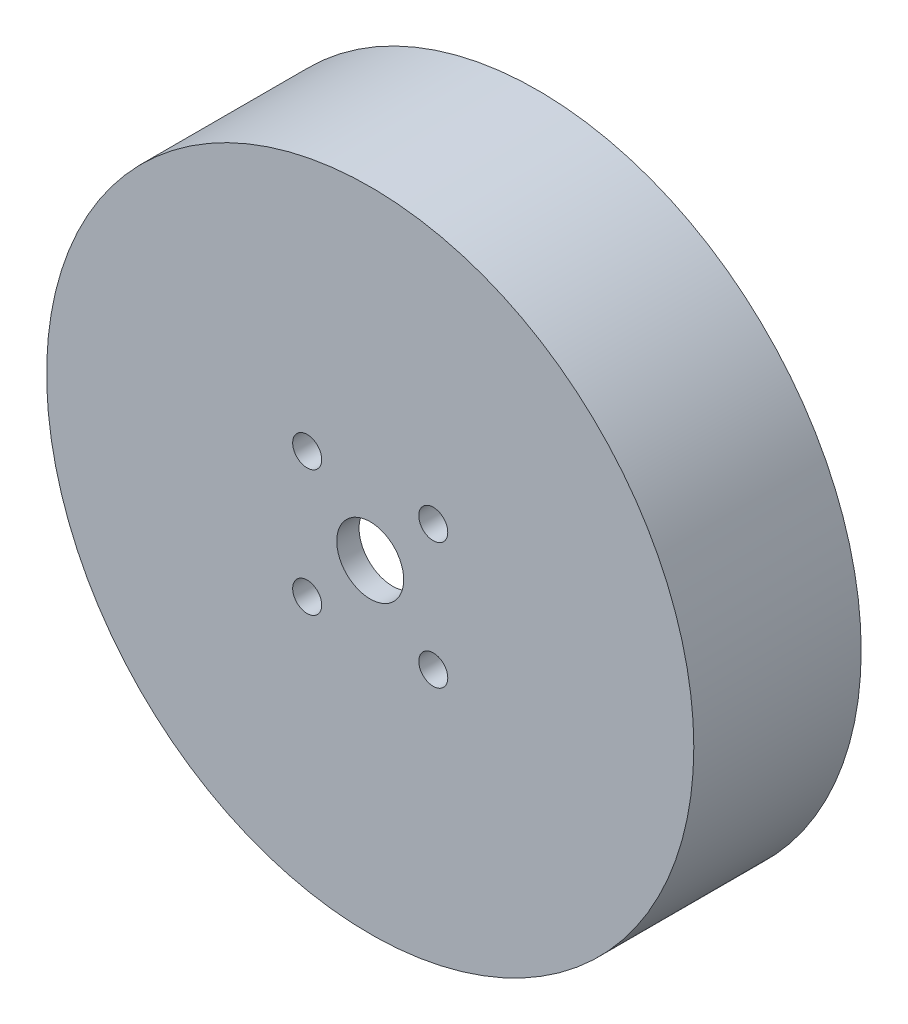
ISO-10303-21;
HEADER;
FILE_DESCRIPTION(('STEP AP214'),'2;1');
FILE_NAME('part.step','',(''),(''),'','','');
FILE_SCHEMA(('AUTOMOTIVE_DESIGN { 1 0 10303 214 1 1 1 1 }'));
ENDSEC;
DATA;
#1=APPLICATION_CONTEXT('core data for automotive mechanical design processes');
#2=APPLICATION_PROTOCOL_DEFINITION('international standard','automotive_design',2000,#1);
#3=PRODUCT_CONTEXT('',#1,'mechanical');
#4=PRODUCT('Part','Part','',(#3));
#5=PRODUCT_RELATED_PRODUCT_CATEGORY('part','',(#4));
#6=PRODUCT_DEFINITION_FORMATION('','',#4);
#7=PRODUCT_DEFINITION_CONTEXT('part definition',#1,'design');
#8=PRODUCT_DEFINITION('design','',#6,#7);
#9=PRODUCT_DEFINITION_SHAPE('','',#8);
#10=(LENGTH_UNIT() NAMED_UNIT(*) SI_UNIT(.MILLI.,.METRE.));
#11=(NAMED_UNIT(*) PLANE_ANGLE_UNIT() SI_UNIT($,.RADIAN.));
#12=(NAMED_UNIT(*) SI_UNIT($,.STERADIAN.) SOLID_ANGLE_UNIT());
#13=UNCERTAINTY_MEASURE_WITH_UNIT(LENGTH_MEASURE(1.E-05),#10,'distance_accuracy_value','');
#14=(GEOMETRIC_REPRESENTATION_CONTEXT(3) GLOBAL_UNCERTAINTY_ASSIGNED_CONTEXT((#13)) GLOBAL_UNIT_ASSIGNED_CONTEXT((#10,
#11,#12)) REPRESENTATION_CONTEXT('',''));
#15=CARTESIAN_POINT('',(0.,0.,0.));
#16=DIRECTION('',(0.,0.,1.));
#17=DIRECTION('',(1.,0.,0.));
#18=AXIS2_PLACEMENT_3D('',#15,#16,#17);
#19=CARTESIAN_POINT('',(0.,0.,13.));
#20=DIRECTION('',(0.,0.,-1.));
#21=DIRECTION('',(-1.,0.,0.));
#22=AXIS2_PLACEMENT_3D('',#19,#20,#21);
#23=CYLINDRICAL_SURFACE('',#22,25.);
#24=CARTESIAN_POINT('',(0.,0.,0.));
#25=DIRECTION('',(0.,0.,-1.));
#26=DIRECTION('',(-1.,0.,0.));
#27=AXIS2_PLACEMENT_3D('',#24,#25,#26);
#28=CIRCLE('',#27,25.);
#29=CARTESIAN_POINT('',(-25.,0.,0.));
#30=VERTEX_POINT('',#29);
#31=EDGE_CURVE('E463',#30,#30,#28,.T.);
#32=ORIENTED_EDGE('',*,*,#31,.T.);
#33=EDGE_LOOP('',(#32));
#34=FACE_BOUND('',#33,.T.);
#35=DIRECTION('',(0.,0.,1.));
#36=VECTOR('',#35,1.);
#37=CARTESIAN_POINT('',(18.6883411946512,16.605598555677,3.));
#38=LINE('',#37,#36);
#39=CARTESIAN_POINT('',(18.6883411946512,16.605598555677,3.));
#40=VERTEX_POINT('',#39);
#41=CARTESIAN_POINT('',(18.6883411946512,16.605598555677,13.));
#42=VERTEX_POINT('',#41);
#43=EDGE_CURVE('E211',#40,#42,#38,.T.);
#44=ORIENTED_EDGE('',*,*,#43,.T.);
#45=CARTESIAN_POINT('',(0.,0.,13.));
#46=DIRECTION('',(0.,0.,-1.));
#47=DIRECTION('',(-1.,0.,0.));
#48=AXIS2_PLACEMENT_3D('',#45,#46,#47);
#49=CIRCLE('',#48,25.);
#50=CARTESIAN_POINT('',(5.78401285092772,24.3217021472656,13.));
#51=VERTEX_POINT('',#50);
#52=EDGE_CURVE('E467',#51,#42,#49,.T.);
#53=ORIENTED_EDGE('',*,*,#52,.F.);
#54=DIRECTION('',(0.,0.,1.));
#55=VECTOR('',#54,1.);
#56=CARTESIAN_POINT('',(5.78401285092772,24.3217021472656,3.));
#57=LINE('',#56,#55);
#58=CARTESIAN_POINT('',(5.78401285092772,24.3217021472656,3.));
#59=VERTEX_POINT('',#58);
#60=EDGE_CURVE('E416',#59,#51,#57,.T.);
#61=ORIENTED_EDGE('',*,*,#60,.F.);
#62=CARTESIAN_POINT('',(0.,0.,3.));
#63=DIRECTION('',(0.,0.,-1.));
#64=DIRECTION('',(-1.,0.,0.));
#65=AXIS2_PLACEMENT_3D('',#62,#63,#64);
#66=CIRCLE('',#65,25.);
#67=CARTESIAN_POINT('',(-5.03669959693659,24.4873775069977,3.));
#68=VERTEX_POINT('',#67);
#69=EDGE_CURVE('E397',#68,#59,#66,.T.);
#70=ORIENTED_EDGE('',*,*,#69,.F.);
#71=DIRECTION('',(0.,0.,1.));
#72=VECTOR('',#71,1.);
#73=CARTESIAN_POINT('',(-5.03669959693659,24.4873775069977,3.));
#74=LINE('',#73,#72);
#75=CARTESIAN_POINT('',(-5.03669959693659,24.4873775069977,13.));
#76=VERTEX_POINT('',#75);
#77=EDGE_CURVE('E419',#68,#76,#74,.T.);
#78=ORIENTED_EDGE('',*,*,#77,.T.);
#79=CARTESIAN_POINT('',(-18.1712054973467,17.1699531383518,13.));
#80=VERTEX_POINT('',#79);
#81=EDGE_CURVE('E472',#80,#76,#49,.T.);
#82=ORIENTED_EDGE('',*,*,#81,.F.);
#83=DIRECTION('',(0.,0.,1.));
#84=VECTOR('',#83,1.);
#85=CARTESIAN_POINT('',(-18.1712054973467,17.1699531383518,3.));
#86=LINE('',#85,#84);
#87=CARTESIAN_POINT('',(-18.1712054973467,17.1699531383518,3.));
#88=VERTEX_POINT('',#87);
#89=EDGE_CURVE('E378',#88,#80,#86,.T.);
#90=ORIENTED_EDGE('',*,*,#89,.F.);
#91=CARTESIAN_POINT('',(0.,0.,3.));
#92=DIRECTION('',(0.,0.,-1.));
#93=DIRECTION('',(-1.,0.,0.));
#94=AXIS2_PLACEMENT_3D('',#91,#92,#93);
#95=CIRCLE('',#94,25.);
#96=CARTESIAN_POINT('',(-23.725040791588,7.88177895132088,3.));
#97=VERTEX_POINT('',#96);
#98=EDGE_CURVE('E359',#97,#88,#95,.T.);
#99=ORIENTED_EDGE('',*,*,#98,.F.);
#100=DIRECTION('',(0.,0.,1.));
#101=VECTOR('',#100,1.);
#102=CARTESIAN_POINT('',(-23.725040791588,7.88177895132088,3.));
#103=LINE('',#102,#101);
#104=CARTESIAN_POINT('',(-23.725040791588,7.88177895132088,13.));
#105=VERTEX_POINT('',#104);
#106=EDGE_CURVE('E381',#97,#105,#103,.T.);
#107=ORIENTED_EDGE('',*,*,#106,.T.);
#108=CARTESIAN_POINT('',(-23.9552183482744,-7.15174900891384,13.));
#109=VERTEX_POINT('',#108);
#110=EDGE_CURVE('E478',#109,#105,#49,.T.);
#111=ORIENTED_EDGE('',*,*,#110,.F.);
#112=DIRECTION('',(0.,0.,1.));
#113=VECTOR('',#112,1.);
#114=CARTESIAN_POINT('',(-23.9552183482743,-7.15174900891383,3.));
#115=LINE('',#114,#113);
#116=CARTESIAN_POINT('',(-23.9552183482743,-7.15174900891383,3.));
#117=VERTEX_POINT('',#116);
#118=EDGE_CURVE('E340',#117,#109,#115,.T.);
#119=ORIENTED_EDGE('',*,*,#118,.F.);
#120=CARTESIAN_POINT('',(0.,0.,3.));
#121=DIRECTION('',(0.,0.,-1.));
#122=DIRECTION('',(-1.,0.,0.));
#123=AXIS2_PLACEMENT_3D('',#120,#121,#122);
#124=CIRCLE('',#123,25.);
#125=CARTESIAN_POINT('',(-18.6883411946513,-16.6055985556769,3.));
#126=VERTEX_POINT('',#125);
#127=EDGE_CURVE('E321',#126,#117,#124,.T.);
#128=ORIENTED_EDGE('',*,*,#127,.F.);
#129=DIRECTION('',(0.,0.,1.));
#130=VECTOR('',#129,1.);
#131=CARTESIAN_POINT('',(-18.6883411946513,-16.6055985556769,3.));
#132=LINE('',#131,#130);
#133=CARTESIAN_POINT('',(-18.6883411946513,-16.6055985556769,13.));
#134=VERTEX_POINT('',#133);
#135=EDGE_CURVE('E343',#126,#134,#132,.T.);
#136=ORIENTED_EDGE('',*,*,#135,.T.);
#137=CARTESIAN_POINT('',(-5.78401285092755,-24.3217021472656,13.));
#138=VERTEX_POINT('',#137);
#139=EDGE_CURVE('E484',#138,#134,#49,.T.);
#140=ORIENTED_EDGE('',*,*,#139,.F.);
#141=DIRECTION('',(0.,0.,1.));
#142=VECTOR('',#141,1.);
#143=CARTESIAN_POINT('',(-5.78401285092755,-24.3217021472656,3.));
#144=LINE('',#143,#142);
#145=CARTESIAN_POINT('',(-5.78401285092755,-24.3217021472656,3.));
#146=VERTEX_POINT('',#145);
#147=EDGE_CURVE('E302',#146,#138,#144,.T.);
#148=ORIENTED_EDGE('',*,*,#147,.F.);
#149=CARTESIAN_POINT('',(0.,0.,3.));
#150=DIRECTION('',(0.,0.,-1.));
#151=DIRECTION('',(-1.,0.,0.));
#152=AXIS2_PLACEMENT_3D('',#149,#150,#151);
#153=CIRCLE('',#152,25.);
#154=CARTESIAN_POINT('',(5.03669959693677,-24.4873775069977,3.));
#155=VERTEX_POINT('',#154);
#156=EDGE_CURVE('E283',#155,#146,#153,.T.);
#157=ORIENTED_EDGE('',*,*,#156,.F.);
#158=DIRECTION('',(0.,0.,1.));
#159=VECTOR('',#158,1.);
#160=CARTESIAN_POINT('',(5.03669959693677,-24.4873775069977,3.));
#161=LINE('',#160,#159);
#162=CARTESIAN_POINT('',(5.03669959693677,-24.4873775069977,13.));
#163=VERTEX_POINT('',#162);
#164=EDGE_CURVE('E305',#155,#163,#161,.T.);
#165=ORIENTED_EDGE('',*,*,#164,.T.);
#166=CARTESIAN_POINT('',(18.1712054973468,-17.1699531383517,13.));
#167=VERTEX_POINT('',#166);
#168=EDGE_CURVE('E489',#167,#163,#49,.T.);
#169=ORIENTED_EDGE('',*,*,#168,.F.);
#170=DIRECTION('',(0.,0.,1.));
#171=VECTOR('',#170,1.);
#172=CARTESIAN_POINT('',(18.1712054973468,-17.1699531383517,3.));
#173=LINE('',#172,#171);
#174=CARTESIAN_POINT('',(18.1712054973468,-17.1699531383517,3.));
#175=VERTEX_POINT('',#174);
#176=EDGE_CURVE('E65',#175,#167,#173,.T.);
#177=ORIENTED_EDGE('',*,*,#176,.F.);
#178=CARTESIAN_POINT('',(0.,0.,3.));
#179=DIRECTION('',(0.,0.,-1.));
#180=DIRECTION('',(-1.,0.,0.));
#181=AXIS2_PLACEMENT_3D('',#178,#179,#180);
#182=CIRCLE('',#181,25.);
#183=CARTESIAN_POINT('',(23.7250407915881,-7.88177895132072,3.));
#184=VERTEX_POINT('',#183);
#185=EDGE_CURVE('E250',#184,#175,#182,.T.);
#186=ORIENTED_EDGE('',*,*,#185,.F.);
#187=DIRECTION('',(0.,0.,1.));
#188=VECTOR('',#187,1.);
#189=CARTESIAN_POINT('',(23.7250407915881,-7.88177895132072,3.));
#190=LINE('',#189,#188);
#191=CARTESIAN_POINT('',(23.7250407915881,-7.88177895132072,13.));
#192=VERTEX_POINT('',#191);
#193=EDGE_CURVE('E267',#184,#192,#190,.T.);
#194=ORIENTED_EDGE('',*,*,#193,.T.);
#195=CARTESIAN_POINT('',(23.9552183482743,7.151749008914,13.));
#196=VERTEX_POINT('',#195);
#197=EDGE_CURVE('E471',#196,#192,#49,.T.);
#198=ORIENTED_EDGE('',*,*,#197,.F.);
#199=DIRECTION('',(0.,0.,1.));
#200=VECTOR('',#199,1.);
#201=CARTESIAN_POINT('',(23.9552183482743,7.151749008914,3.));
#202=LINE('',#201,#200);
#203=CARTESIAN_POINT('',(23.9552183482743,7.151749008914,3.));
#204=VERTEX_POINT('',#203);
#205=EDGE_CURVE('E57',#204,#196,#202,.T.);
#206=ORIENTED_EDGE('',*,*,#205,.F.);
#207=CARTESIAN_POINT('',(0.,0.,3.));
#208=DIRECTION('',(0.,0.,-1.));
#209=DIRECTION('',(-1.,0.,0.));
#210=AXIS2_PLACEMENT_3D('',#207,#208,#209);
#211=CIRCLE('',#210,25.);
#212=EDGE_CURVE('E215',#40,#204,#211,.T.);
#213=ORIENTED_EDGE('',*,*,#212,.F.);
#214=EDGE_LOOP('',(#44,#53,#61,#70,#78,#82,#90,#99,#107,#111,#119,#128,#136,#140,#148,#157,#165,
#169,#177,#186,#194,#198,#206,#213));
#215=FACE_BOUND('',#214,.T.);
#216=ADVANCED_FACE('F41',(#34,#215),#23,.F.);
#217=CARTESIAN_POINT('',(0.,0.,13.));
#218=DIRECTION('',(0.,0.,-1.));
#219=DIRECTION('',(-1.,0.,0.));
#220=AXIS2_PLACEMENT_3D('',#217,#218,#219);
#221=PLANE('',#220);
#222=CARTESIAN_POINT('',(0.,0.,13.));
#223=DIRECTION('',(0.,0.,-1.));
#224=DIRECTION('',(-1.,0.,0.));
#225=AXIS2_PLACEMENT_3D('',#222,#223,#224);
#226=CIRCLE('',#225,3.);
#227=CARTESIAN_POINT('',(-3.,0.,13.));
#228=VERTEX_POINT('',#227);
#229=EDGE_CURVE('E426',#228,#228,#226,.F.);
#230=ORIENTED_EDGE('',*,*,#229,.T.);
#231=EDGE_LOOP('',(#230));
#232=FACE_BOUND('',#231,.T.);
#233=CARTESIAN_POINT('',(-5.65,5.65,13.));
#234=DIRECTION('',(0.,0.,-1.));
#235=DIRECTION('',(-1.,0.,0.));
#236=AXIS2_PLACEMENT_3D('',#233,#234,#235);
#237=CIRCLE('',#236,1.3);
#238=CARTESIAN_POINT('',(-6.95,5.65,13.));
#239=VERTEX_POINT('',#238);
#240=EDGE_CURVE('E448',#239,#239,#237,.F.);
#241=ORIENTED_EDGE('',*,*,#240,.T.);
#242=EDGE_LOOP('',(#241));
#243=FACE_BOUND('',#242,.T.);
#244=CARTESIAN_POINT('',(-5.65,-5.65,13.));
#245=DIRECTION('',(0.,0.,-1.));
#246=DIRECTION('',(-1.,0.,0.));
#247=AXIS2_PLACEMENT_3D('',#244,#245,#246);
#248=CIRCLE('',#247,1.3);
#249=CARTESIAN_POINT('',(-6.95,-5.65,13.));
#250=VERTEX_POINT('',#249);
#251=EDGE_CURVE('E440',#250,#250,#248,.F.);
#252=ORIENTED_EDGE('',*,*,#251,.T.);
#253=EDGE_LOOP('',(#252));
#254=FACE_BOUND('',#253,.T.);
#255=CARTESIAN_POINT('',(5.65,-5.65,13.));
#256=DIRECTION('',(0.,0.,-1.));
#257=DIRECTION('',(-1.,0.,0.));
#258=AXIS2_PLACEMENT_3D('',#255,#256,#257);
#259=CIRCLE('',#258,1.3);
#260=CARTESIAN_POINT('',(4.35,-5.65,13.));
#261=VERTEX_POINT('',#260);
#262=EDGE_CURVE('E432',#261,#261,#259,.F.);
#263=ORIENTED_EDGE('',*,*,#262,.T.);
#264=EDGE_LOOP('',(#263));
#265=FACE_BOUND('',#264,.T.);
#266=CARTESIAN_POINT('',(5.65,5.65,13.));
#267=DIRECTION('',(0.,0.,-1.));
#268=DIRECTION('',(-1.,0.,0.));
#269=AXIS2_PLACEMENT_3D('',#266,#267,#268);
#270=CIRCLE('',#269,1.3);
#271=CARTESIAN_POINT('',(4.35,5.65,13.));
#272=VERTEX_POINT('',#271);
#273=EDGE_CURVE('E431',#272,#272,#270,.F.);
#274=ORIENTED_EDGE('',*,*,#273,.T.);
#275=EDGE_LOOP('',(#274));
#276=FACE_BOUND('',#275,.T.);
#277=ORIENTED_EDGE('',*,*,#52,.T.);
#278=DIRECTION('',(0.747533647786048,0.664223942227081,0.));
#279=VECTOR('',#278,1.);
#280=CARTESIAN_POINT('',(12.8949554243093,11.4578630034171,13.));
#281=LINE('',#280,#279);
#282=CARTESIAN_POINT('',(12.8949554243093,11.4578630034171,13.));
#283=VERTEX_POINT('',#282);
#284=EDGE_CURVE('E572',#283,#42,#281,.T.);
#285=ORIENTED_EDGE('',*,*,#284,.F.);
#286=CARTESIAN_POINT('',(0.,0.,13.));
#287=DIRECTION('',(0.,0.,1.));
#288=DIRECTION('',(-1.,0.,0.));
#289=AXIS2_PLACEMENT_3D('',#286,#287,#288);
#290=CIRCLE('',#289,17.25);
#291=CARTESIAN_POINT('',(16.5291006603093,4.93470681615066,13.));
#292=VERTEX_POINT('',#291);
#293=EDGE_CURVE('E229',#292,#283,#290,.T.);
#294=ORIENTED_EDGE('',*,*,#293,.F.);
#295=DIRECTION('',(-0.958208733930972,-0.28606996035656,0.));
#296=VECTOR('',#295,1.);
#297=CARTESIAN_POINT('',(16.5291006603093,4.93470681615066,13.));
#298=LINE('',#297,#296);
#299=EDGE_CURVE('E225',#196,#292,#298,.T.);
#300=ORIENTED_EDGE('',*,*,#299,.F.);
#301=ORIENTED_EDGE('',*,*,#197,.T.);
#302=DIRECTION('',(0.949001631663523,-0.315271158052829,0.));
#303=VECTOR('',#302,1.);
#304=CARTESIAN_POINT('',(16.3702781461958,-5.4384274764113,13.));
#305=LINE('',#304,#303);
#306=CARTESIAN_POINT('',(16.3702781461958,-5.4384274764113,13.));
#307=VERTEX_POINT('',#306);
#308=EDGE_CURVE('E237',#307,#192,#305,.T.);
#309=ORIENTED_EDGE('',*,*,#308,.F.);
#310=CARTESIAN_POINT('',(0.,0.,13.));
#311=DIRECTION('',(0.,0.,1.));
#312=DIRECTION('',(-1.,0.,0.));
#313=AXIS2_PLACEMENT_3D('',#310,#311,#312);
#314=CIRCLE('',#313,17.25);
#315=CARTESIAN_POINT('',(12.5381317931693,-11.8472676654627,13.));
#316=VERTEX_POINT('',#315);
#317=EDGE_CURVE('E232',#316,#307,#314,.T.);
#318=ORIENTED_EDGE('',*,*,#317,.F.);
#319=DIRECTION('',(-0.726848219893873,0.686798125534067,0.));
#320=VECTOR('',#319,1.);
#321=CARTESIAN_POINT('',(12.5381317931693,-11.8472676654627,13.));
#322=LINE('',#321,#320);
#323=EDGE_CURVE('E247',#167,#316,#322,.T.);
#324=ORIENTED_EDGE('',*,*,#323,.F.);
#325=ORIENTED_EDGE('',*,*,#168,.T.);
#326=DIRECTION('',(0.201467983877471,-0.979495100279908,0.));
#327=VECTOR('',#326,1.);
#328=CARTESIAN_POINT('',(3.47532272188637,-16.8962904798284,13.));
#329=LINE('',#328,#327);
#330=CARTESIAN_POINT('',(3.47532272188637,-16.8962904798284,13.));
#331=VERTEX_POINT('',#330);
#332=EDGE_CURVE('E293',#331,#163,#329,.T.);
#333=ORIENTED_EDGE('',*,*,#332,.F.);
#334=CARTESIAN_POINT('',(0.,0.,13.));
#335=DIRECTION('',(0.,0.,1.));
#336=DIRECTION('',(-1.,0.,0.));
#337=AXIS2_PLACEMENT_3D('',#334,#335,#336);
#338=CIRCLE('',#337,17.25);
#339=CARTESIAN_POINT('',(-3.99096886714001,-16.7819744816133,13.));
#340=VERTEX_POINT('',#339);
#341=EDGE_CURVE('E274',#340,#331,#338,.T.);
#342=ORIENTED_EDGE('',*,*,#341,.F.);
#343=DIRECTION('',(0.231360514037102,0.972868085890625,0.));
#344=VECTOR('',#343,1.);
#345=CARTESIAN_POINT('',(-3.99096886714001,-16.7819744816133,13.));
#346=LINE('',#345,#344);
#347=EDGE_CURVE('E280',#138,#340,#346,.T.);
#348=ORIENTED_EDGE('',*,*,#347,.F.);
#349=ORIENTED_EDGE('',*,*,#139,.T.);
#350=DIRECTION('',(-0.747533647786053,-0.664223942227076,0.));
#351=VECTOR('',#350,1.);
#352=CARTESIAN_POINT('',(-12.8949554243094,-11.457863003417,13.));
#353=LINE('',#352,#351);
#354=CARTESIAN_POINT('',(-12.8949554243094,-11.457863003417,13.));
#355=VERTEX_POINT('',#354);
#356=EDGE_CURVE('E331',#355,#134,#353,.T.);
#357=ORIENTED_EDGE('',*,*,#356,.F.);
#358=CARTESIAN_POINT('',(0.,0.,13.));
#359=DIRECTION('',(0.,0.,1.));
#360=DIRECTION('',(-1.,0.,0.));
#361=AXIS2_PLACEMENT_3D('',#358,#359,#360);
#362=CIRCLE('',#361,17.25);
#363=CARTESIAN_POINT('',(-16.5291006603093,-4.93470681615055,13.));
#364=VERTEX_POINT('',#363);
#365=EDGE_CURVE('E312',#364,#355,#362,.T.);
#366=ORIENTED_EDGE('',*,*,#365,.F.);
#367=DIRECTION('',(0.958208733930974,0.286069960356554,0.));
#368=VECTOR('',#367,1.);
#369=CARTESIAN_POINT('',(-16.5291006603093,-4.93470681615055,13.));
#370=LINE('',#369,#368);
#371=EDGE_CURVE('E318',#109,#364,#370,.T.);
#372=ORIENTED_EDGE('',*,*,#371,.F.);
#373=ORIENTED_EDGE('',*,*,#110,.T.);
#374=DIRECTION('',(-0.949001631663521,0.315271158052835,0.));
#375=VECTOR('',#374,1.);
#376=CARTESIAN_POINT('',(-16.3702781461957,5.43842747641141,13.));
#377=LINE('',#376,#375);
#378=CARTESIAN_POINT('',(-16.3702781461957,5.43842747641141,13.));
#379=VERTEX_POINT('',#378);
#380=EDGE_CURVE('E369',#379,#105,#377,.T.);
#381=ORIENTED_EDGE('',*,*,#380,.F.);
#382=CARTESIAN_POINT('',(0.,0.,13.));
#383=DIRECTION('',(0.,0.,1.));
#384=DIRECTION('',(-1.,0.,0.));
#385=AXIS2_PLACEMENT_3D('',#382,#383,#384);
#386=CIRCLE('',#385,17.25);
#387=CARTESIAN_POINT('',(-12.5381317931692,11.8472676654627,13.));
#388=VERTEX_POINT('',#387);
#389=EDGE_CURVE('E350',#388,#379,#386,.T.);
#390=ORIENTED_EDGE('',*,*,#389,.F.);
#391=DIRECTION('',(0.726848219893868,-0.686798125534072,0.));
#392=VECTOR('',#391,1.);
#393=CARTESIAN_POINT('',(-12.5381317931692,11.8472676654627,13.));
#394=LINE('',#393,#392);
#395=EDGE_CURVE('E356',#80,#388,#394,.T.);
#396=ORIENTED_EDGE('',*,*,#395,.F.);
#397=ORIENTED_EDGE('',*,*,#81,.T.);
#398=DIRECTION('',(-0.201467983877464,0.97949510027991,0.));
#399=VECTOR('',#398,1.);
#400=CARTESIAN_POINT('',(-3.47532272188625,16.8962904798284,13.));
#401=LINE('',#400,#399);
#402=CARTESIAN_POINT('',(-3.47532272188625,16.8962904798284,13.));
#403=VERTEX_POINT('',#402);
#404=EDGE_CURVE('E407',#403,#76,#401,.T.);
#405=ORIENTED_EDGE('',*,*,#404,.F.);
#406=CARTESIAN_POINT('',(0.,0.,13.));
#407=DIRECTION('',(0.,0.,1.));
#408=DIRECTION('',(-1.,0.,0.));
#409=AXIS2_PLACEMENT_3D('',#406,#407,#408);
#410=CIRCLE('',#409,17.25);
#411=CARTESIAN_POINT('',(3.99096886714013,16.7819744816132,13.));
#412=VERTEX_POINT('',#411);
#413=EDGE_CURVE('E388',#412,#403,#410,.T.);
#414=ORIENTED_EDGE('',*,*,#413,.F.);
#415=DIRECTION('',(-0.231360514037109,-0.972868085890623,0.));
#416=VECTOR('',#415,1.);
#417=CARTESIAN_POINT('',(3.99096886714013,16.7819744816132,13.));
#418=LINE('',#417,#416);
#419=EDGE_CURVE('E394',#51,#412,#418,.T.);
#420=ORIENTED_EDGE('',*,*,#419,.F.);
#421=EDGE_LOOP('',(#277,#285,#294,#300,#301,#309,#318,#324,#325,#333,#342,#348,#349,#357,#366,
#372,#373,#381,#390,#396,#397,#405,#414,#420));
#422=FACE_BOUND('',#421,.T.);
#423=ADVANCED_FACE('F499',(#232,#243,#254,#265,#276,#422),#221,.T.);
#424=CARTESIAN_POINT('',(0.,0.,15.));
#425=DIRECTION('',(0.,0.,-1.));
#426=DIRECTION('',(-1.,0.,0.));
#427=AXIS2_PLACEMENT_3D('',#424,#425,#426);
#428=CYLINDRICAL_SURFACE('',#427,29.);
#429=CARTESIAN_POINT('',(0.,0.,15.));
#430=DIRECTION('',(0.,0.,1.));
#431=DIRECTION('',(1.,0.,0.));
#432=AXIS2_PLACEMENT_3D('',#429,#430,#431);
#433=CIRCLE('',#432,29.);
#434=CARTESIAN_POINT('',(29.,0.,15.));
#435=VERTEX_POINT('',#434);
#436=EDGE_CURVE('E11',#435,#435,#433,.T.);
#437=ORIENTED_EDGE('',*,*,#436,.F.);
#438=EDGE_LOOP('',(#437));
#439=FACE_BOUND('',#438,.T.);
#440=CARTESIAN_POINT('',(0.,0.,0.));
#441=DIRECTION('',(0.,0.,1.));
#442=DIRECTION('',(1.,0.,0.));
#443=AXIS2_PLACEMENT_3D('',#440,#441,#442);
#444=CIRCLE('',#443,29.);
#445=CARTESIAN_POINT('',(29.,0.,0.));
#446=VERTEX_POINT('',#445);
#447=EDGE_CURVE('E45',#446,#446,#444,.T.);
#448=ORIENTED_EDGE('',*,*,#447,.T.);
#449=EDGE_LOOP('',(#448));
#450=FACE_BOUND('',#449,.T.);
#451=ADVANCED_FACE('F43',(#439,#450),#428,.T.);
#452=CARTESIAN_POINT('',(0.,0.,15.));
#453=DIRECTION('',(0.,0.,1.));
#454=DIRECTION('',(1.,0.,0.));
#455=AXIS2_PLACEMENT_3D('',#452,#453,#454);
#456=PLANE('',#455);
#457=CARTESIAN_POINT('',(0.,0.,15.));
#458=DIRECTION('',(0.,0.,1.));
#459=DIRECTION('',(1.,0.,0.));
#460=AXIS2_PLACEMENT_3D('',#457,#458,#459);
#461=CIRCLE('',#460,3.);
#462=CARTESIAN_POINT('',(3.,0.,15.));
#463=VERTEX_POINT('',#462);
#464=EDGE_CURVE('E452',#463,#463,#461,.T.);
#465=ORIENTED_EDGE('',*,*,#464,.F.);
#466=EDGE_LOOP('',(#465));
#467=FACE_BOUND('',#466,.T.);
#468=CARTESIAN_POINT('',(-5.65,5.65,15.));
#469=DIRECTION('',(0.,0.,1.));
#470=DIRECTION('',(1.,0.,0.));
#471=AXIS2_PLACEMENT_3D('',#468,#469,#470);
#472=CIRCLE('',#471,1.3);
#473=CARTESIAN_POINT('',(-4.35,5.65,15.));
#474=VERTEX_POINT('',#473);
#475=EDGE_CURVE('E444',#474,#474,#472,.T.);
#476=ORIENTED_EDGE('',*,*,#475,.F.);
#477=EDGE_LOOP('',(#476));
#478=FACE_BOUND('',#477,.T.);
#479=CARTESIAN_POINT('',(-5.65,-5.65,15.));
#480=DIRECTION('',(0.,0.,1.));
#481=DIRECTION('',(1.,0.,0.));
#482=AXIS2_PLACEMENT_3D('',#479,#480,#481);
#483=CIRCLE('',#482,1.3);
#484=CARTESIAN_POINT('',(-4.35,-5.65,15.));
#485=VERTEX_POINT('',#484);
#486=EDGE_CURVE('E436',#485,#485,#483,.T.);
#487=ORIENTED_EDGE('',*,*,#486,.F.);
#488=EDGE_LOOP('',(#487));
#489=FACE_BOUND('',#488,.T.);
#490=CARTESIAN_POINT('',(5.65,-5.65,15.));
#491=DIRECTION('',(0.,0.,1.));
#492=DIRECTION('',(1.,0.,0.));
#493=AXIS2_PLACEMENT_3D('',#490,#491,#492);
#494=CIRCLE('',#493,1.3);
#495=CARTESIAN_POINT('',(6.95,-5.65,15.));
#496=VERTEX_POINT('',#495);
#497=EDGE_CURVE('E427',#496,#496,#494,.T.);
#498=ORIENTED_EDGE('',*,*,#497,.F.);
#499=EDGE_LOOP('',(#498));
#500=FACE_BOUND('',#499,.T.);
#501=CARTESIAN_POINT('',(5.65,5.65,15.));
#502=DIRECTION('',(0.,0.,1.));
#503=DIRECTION('',(1.,0.,0.));
#504=AXIS2_PLACEMENT_3D('',#501,#502,#503);
#505=CIRCLE('',#504,1.3);
#506=CARTESIAN_POINT('',(6.95,5.65,15.));
#507=VERTEX_POINT('',#506);
#508=EDGE_CURVE('E459',#507,#507,#505,.T.);
#509=ORIENTED_EDGE('',*,*,#508,.F.);
#510=EDGE_LOOP('',(#509));
#511=FACE_BOUND('',#510,.T.);
#512=ORIENTED_EDGE('',*,*,#436,.T.);
#513=EDGE_LOOP('',(#512));
#514=FACE_BOUND('',#513,.T.);
#515=ADVANCED_FACE('F605',(#467,#478,#489,#500,#511,#514),#456,.T.);
#516=CARTESIAN_POINT('',(0.,0.,0.));
#517=DIRECTION('',(0.,0.,1.));
#518=DIRECTION('',(1.,0.,0.));
#519=AXIS2_PLACEMENT_3D('',#516,#517,#518);
#520=PLANE('',#519);
#521=ORIENTED_EDGE('',*,*,#31,.F.);
#522=EDGE_LOOP('',(#521));
#523=FACE_BOUND('',#522,.T.);
#524=ORIENTED_EDGE('',*,*,#447,.F.);
#525=EDGE_LOOP('',(#524));
#526=FACE_BOUND('',#525,.T.);
#527=ADVANCED_FACE('F607',(#523,#526),#520,.F.);
#528=CARTESIAN_POINT('',(5.65,5.65,-0.000999999999999265));
#529=DIRECTION('',(0.,0.,1.));
#530=DIRECTION('',(1.,0.,0.));
#531=AXIS2_PLACEMENT_3D('',#528,#529,#530);
#532=CYLINDRICAL_SURFACE('',#531,1.3);
#533=ORIENTED_EDGE('',*,*,#273,.F.);
#534=EDGE_LOOP('',(#533));
#535=FACE_BOUND('',#534,.T.);
#536=ORIENTED_EDGE('',*,*,#508,.T.);
#537=EDGE_LOOP('',(#536));
#538=FACE_BOUND('',#537,.T.);
#539=ADVANCED_FACE('F610',(#535,#538),#532,.F.);
#540=CARTESIAN_POINT('',(5.65,-5.65,-0.000999999999999265));
#541=DIRECTION('',(0.,0.,1.));
#542=DIRECTION('',(1.,0.,0.));
#543=AXIS2_PLACEMENT_3D('',#540,#541,#542);
#544=CYLINDRICAL_SURFACE('',#543,1.3);
#545=ORIENTED_EDGE('',*,*,#262,.F.);
#546=EDGE_LOOP('',(#545));
#547=FACE_BOUND('',#546,.T.);
#548=ORIENTED_EDGE('',*,*,#497,.T.);
#549=EDGE_LOOP('',(#548));
#550=FACE_BOUND('',#549,.T.);
#551=ADVANCED_FACE('F615',(#547,#550),#544,.F.);
#552=CARTESIAN_POINT('',(-5.65,-5.65,-0.000999999999999265));
#553=DIRECTION('',(0.,0.,1.));
#554=DIRECTION('',(1.,0.,0.));
#555=AXIS2_PLACEMENT_3D('',#552,#553,#554);
#556=CYLINDRICAL_SURFACE('',#555,1.3);
#557=ORIENTED_EDGE('',*,*,#251,.F.);
#558=EDGE_LOOP('',(#557));
#559=FACE_BOUND('',#558,.T.);
#560=ORIENTED_EDGE('',*,*,#486,.T.);
#561=EDGE_LOOP('',(#560));
#562=FACE_BOUND('',#561,.T.);
#563=ADVANCED_FACE('F661',(#559,#562),#556,.F.);
#564=CARTESIAN_POINT('',(-5.65,5.65,-0.000999999999999265));
#565=DIRECTION('',(0.,0.,1.));
#566=DIRECTION('',(1.,0.,0.));
#567=AXIS2_PLACEMENT_3D('',#564,#565,#566);
#568=CYLINDRICAL_SURFACE('',#567,1.3);
#569=ORIENTED_EDGE('',*,*,#240,.F.);
#570=EDGE_LOOP('',(#569));
#571=FACE_BOUND('',#570,.T.);
#572=ORIENTED_EDGE('',*,*,#475,.T.);
#573=EDGE_LOOP('',(#572));
#574=FACE_BOUND('',#573,.T.);
#575=ADVANCED_FACE('F670',(#571,#574),#568,.F.);
#576=CARTESIAN_POINT('',(0.,0.,-0.000999999999999265));
#577=DIRECTION('',(0.,0.,1.));
#578=DIRECTION('',(1.,0.,0.));
#579=AXIS2_PLACEMENT_3D('',#576,#577,#578);
#580=CYLINDRICAL_SURFACE('',#579,3.);
#581=ORIENTED_EDGE('',*,*,#229,.F.);
#582=EDGE_LOOP('',(#581));
#583=FACE_BOUND('',#582,.T.);
#584=ORIENTED_EDGE('',*,*,#464,.T.);
#585=EDGE_LOOP('',(#584));
#586=FACE_BOUND('',#585,.T.);
#587=ADVANCED_FACE('F679',(#583,#586),#580,.F.);
#588=CARTESIAN_POINT('',(0.,0.,3.));
#589=DIRECTION('',(0.,0.,1.));
#590=DIRECTION('',(1.,0.,0.));
#591=AXIS2_PLACEMENT_3D('',#588,#589,#590);
#592=CYLINDRICAL_SURFACE('',#591,17.25);
#593=ORIENTED_EDGE('',*,*,#413,.T.);
#594=DIRECTION('',(0.,0.,1.));
#595=VECTOR('',#594,1.);
#596=CARTESIAN_POINT('',(-3.47532272188625,16.8962904798284,3.));
#597=LINE('',#596,#595);
#598=CARTESIAN_POINT('',(-3.47532272188625,16.8962904798284,3.));
#599=VERTEX_POINT('',#598);
#600=EDGE_CURVE('E423',#599,#403,#597,.T.);
#601=ORIENTED_EDGE('',*,*,#600,.F.);
#602=CARTESIAN_POINT('',(0.,0.,3.));
#603=DIRECTION('',(0.,0.,1.));
#604=DIRECTION('',(-1.,0.,0.));
#605=AXIS2_PLACEMENT_3D('',#602,#603,#604);
#606=CIRCLE('',#605,17.25);
#607=CARTESIAN_POINT('',(3.99096886714013,16.7819744816132,3.));
#608=VERTEX_POINT('',#607);
#609=EDGE_CURVE('E389',#608,#599,#606,.T.);
#610=ORIENTED_EDGE('',*,*,#609,.F.);
#611=DIRECTION('',(0.,0.,1.));
#612=VECTOR('',#611,1.);
#613=CARTESIAN_POINT('',(3.99096886714013,16.7819744816132,3.));
#614=LINE('',#613,#612);
#615=EDGE_CURVE('E403',#608,#412,#614,.T.);
#616=ORIENTED_EDGE('',*,*,#615,.T.);
#617=EDGE_LOOP('',(#593,#601,#610,#616));
#618=FACE_BOUND('',#617,.T.);
#619=ADVANCED_FACE('F566',(#618),#592,.F.);
#620=CARTESIAN_POINT('',(-3.47532272188625,16.8962904798284,3.));
#621=DIRECTION('',(0.97949510027991,0.201467983877464,0.));
#622=DIRECTION('',(-0.201467983877464,0.97949510027991,0.));
#623=AXIS2_PLACEMENT_3D('',#620,#621,#622);
#624=PLANE('',#623);
#625=ORIENTED_EDGE('',*,*,#404,.T.);
#626=ORIENTED_EDGE('',*,*,#77,.F.);
#627=DIRECTION('',(-0.201467983877464,0.97949510027991,0.));
#628=VECTOR('',#627,1.);
#629=CARTESIAN_POINT('',(-3.47532272188625,16.8962904798284,3.));
#630=LINE('',#629,#628);
#631=EDGE_CURVE('E393',#599,#68,#630,.T.);
#632=ORIENTED_EDGE('',*,*,#631,.F.);
#633=ORIENTED_EDGE('',*,*,#600,.T.);
#634=EDGE_LOOP('',(#625,#626,#632,#633));
#635=FACE_BOUND('',#634,.T.);
#636=ADVANCED_FACE('F560',(#635),#624,.F.);
#637=CARTESIAN_POINT('',(3.99096886714013,16.7819744816132,3.));
#638=DIRECTION('',(-0.972868085890623,0.231360514037109,0.));
#639=DIRECTION('',(-0.231360514037109,-0.972868085890623,0.));
#640=AXIS2_PLACEMENT_3D('',#637,#638,#639);
#641=PLANE('',#640);
#642=ORIENTED_EDGE('',*,*,#419,.T.);
#643=ORIENTED_EDGE('',*,*,#615,.F.);
#644=DIRECTION('',(-0.231360514037109,-0.972868085890623,0.));
#645=VECTOR('',#644,1.);
#646=CARTESIAN_POINT('',(3.99096886714013,16.7819744816132,3.));
#647=LINE('',#646,#645);
#648=EDGE_CURVE('E400',#59,#608,#647,.T.);
#649=ORIENTED_EDGE('',*,*,#648,.F.);
#650=ORIENTED_EDGE('',*,*,#60,.T.);
#651=EDGE_LOOP('',(#642,#643,#649,#650));
#652=FACE_BOUND('',#651,.T.);
#653=ADVANCED_FACE('F571',(#652),#641,.F.);
#654=CARTESIAN_POINT('',(0.,0.,3.));
#655=DIRECTION('',(0.,0.,-1.));
#656=DIRECTION('',(-1.,0.,0.));
#657=AXIS2_PLACEMENT_3D('',#654,#655,#656);
#658=PLANE('',#657);
#659=ORIENTED_EDGE('',*,*,#609,.T.);
#660=ORIENTED_EDGE('',*,*,#631,.T.);
#661=ORIENTED_EDGE('',*,*,#69,.T.);
#662=ORIENTED_EDGE('',*,*,#648,.T.);
#663=EDGE_LOOP('',(#659,#660,#661,#662));
#664=FACE_BOUND('',#663,.T.);
#665=ADVANCED_FACE('F721',(#664),#658,.T.);
#666=CARTESIAN_POINT('',(0.,0.,3.));
#667=DIRECTION('',(0.,0.,1.));
#668=DIRECTION('',(1.,0.,0.));
#669=AXIS2_PLACEMENT_3D('',#666,#667,#668);
#670=CYLINDRICAL_SURFACE('',#669,17.25);
#671=ORIENTED_EDGE('',*,*,#389,.T.);
#672=DIRECTION('',(0.,0.,1.));
#673=VECTOR('',#672,1.);
#674=CARTESIAN_POINT('',(-16.3702781461957,5.43842747641141,3.));
#675=LINE('',#674,#673);
#676=CARTESIAN_POINT('',(-16.3702781461957,5.43842747641141,3.));
#677=VERTEX_POINT('',#676);
#678=EDGE_CURVE('E385',#677,#379,#675,.T.);
#679=ORIENTED_EDGE('',*,*,#678,.F.);
#680=CARTESIAN_POINT('',(0.,0.,3.));
#681=DIRECTION('',(0.,0.,1.));
#682=DIRECTION('',(-1.,0.,0.));
#683=AXIS2_PLACEMENT_3D('',#680,#681,#682);
#684=CIRCLE('',#683,17.25);
#685=CARTESIAN_POINT('',(-12.5381317931692,11.8472676654627,3.));
#686=VERTEX_POINT('',#685);
#687=EDGE_CURVE('E351',#686,#677,#684,.T.);
#688=ORIENTED_EDGE('',*,*,#687,.F.);
#689=DIRECTION('',(0.,0.,1.));
#690=VECTOR('',#689,1.);
#691=CARTESIAN_POINT('',(-12.5381317931692,11.8472676654627,3.));
#692=LINE('',#691,#690);
#693=EDGE_CURVE('E365',#686,#388,#692,.T.);
#694=ORIENTED_EDGE('',*,*,#693,.T.);
#695=EDGE_LOOP('',(#671,#679,#688,#694));
#696=FACE_BOUND('',#695,.T.);
#697=ADVANCED_FACE('F550',(#696),#670,.F.);
#698=CARTESIAN_POINT('',(-16.3702781461957,5.43842747641141,3.));
#699=DIRECTION('',(0.315271158052835,0.94900163166352,0.));
#700=DIRECTION('',(-0.94900163166352,0.315271158052835,0.));
#701=AXIS2_PLACEMENT_3D('',#698,#699,#700);
#702=PLANE('',#701);
#703=ORIENTED_EDGE('',*,*,#380,.T.);
#704=ORIENTED_EDGE('',*,*,#106,.F.);
#705=DIRECTION('',(-0.949001631663521,0.315271158052835,0.));
#706=VECTOR('',#705,1.);
#707=CARTESIAN_POINT('',(-16.3702781461957,5.43842747641141,3.));
#708=LINE('',#707,#706);
#709=EDGE_CURVE('E355',#677,#97,#708,.T.);
#710=ORIENTED_EDGE('',*,*,#709,.F.);
#711=ORIENTED_EDGE('',*,*,#678,.T.);
#712=EDGE_LOOP('',(#703,#704,#710,#711));
#713=FACE_BOUND('',#712,.T.);
#714=ADVANCED_FACE('F546',(#713),#702,.F.);
#715=CARTESIAN_POINT('',(-12.5381317931692,11.8472676654627,3.));
#716=DIRECTION('',(-0.686798125534072,-0.726848219893868,0.));
#717=DIRECTION('',(0.726848219893868,-0.686798125534072,0.));
#718=AXIS2_PLACEMENT_3D('',#715,#716,#717);
#719=PLANE('',#718);
#720=ORIENTED_EDGE('',*,*,#395,.T.);
#721=ORIENTED_EDGE('',*,*,#693,.F.);
#722=DIRECTION('',(0.726848219893868,-0.686798125534072,0.));
#723=VECTOR('',#722,1.);
#724=CARTESIAN_POINT('',(-12.5381317931692,11.8472676654627,3.));
#725=LINE('',#724,#723);
#726=EDGE_CURVE('E362',#88,#686,#725,.T.);
#727=ORIENTED_EDGE('',*,*,#726,.F.);
#728=ORIENTED_EDGE('',*,*,#89,.T.);
#729=EDGE_LOOP('',(#720,#721,#727,#728));
#730=FACE_BOUND('',#729,.T.);
#731=ADVANCED_FACE('F555',(#730),#719,.F.);
#732=CARTESIAN_POINT('',(0.,0.,3.));
#733=DIRECTION('',(0.,0.,-1.));
#734=DIRECTION('',(-1.,0.,0.));
#735=AXIS2_PLACEMENT_3D('',#732,#733,#734);
#736=PLANE('',#735);
#737=ORIENTED_EDGE('',*,*,#687,.T.);
#738=ORIENTED_EDGE('',*,*,#709,.T.);
#739=ORIENTED_EDGE('',*,*,#98,.T.);
#740=ORIENTED_EDGE('',*,*,#726,.T.);
#741=EDGE_LOOP('',(#737,#738,#739,#740));
#742=FACE_BOUND('',#741,.T.);
#743=ADVANCED_FACE('F753',(#742),#736,.T.);
#744=CARTESIAN_POINT('',(0.,0.,3.));
#745=DIRECTION('',(0.,0.,1.));
#746=DIRECTION('',(1.,0.,0.));
#747=AXIS2_PLACEMENT_3D('',#744,#745,#746);
#748=CYLINDRICAL_SURFACE('',#747,17.25);
#749=ORIENTED_EDGE('',*,*,#365,.T.);
#750=DIRECTION('',(0.,0.,1.));
#751=VECTOR('',#750,1.);
#752=CARTESIAN_POINT('',(-12.8949554243094,-11.457863003417,3.));
#753=LINE('',#752,#751);
#754=CARTESIAN_POINT('',(-12.8949554243094,-11.457863003417,3.));
#755=VERTEX_POINT('',#754);
#756=EDGE_CURVE('E347',#755,#355,#753,.T.);
#757=ORIENTED_EDGE('',*,*,#756,.F.);
#758=CARTESIAN_POINT('',(0.,0.,3.));
#759=DIRECTION('',(0.,0.,1.));
#760=DIRECTION('',(-1.,0.,0.));
#761=AXIS2_PLACEMENT_3D('',#758,#759,#760);
#762=CIRCLE('',#761,17.25);
#763=CARTESIAN_POINT('',(-16.5291006603093,-4.93470681615055,3.));
#764=VERTEX_POINT('',#763);
#765=EDGE_CURVE('E313',#764,#755,#762,.T.);
#766=ORIENTED_EDGE('',*,*,#765,.F.);
#767=DIRECTION('',(0.,0.,1.));
#768=VECTOR('',#767,1.);
#769=CARTESIAN_POINT('',(-16.5291006603093,-4.93470681615055,3.));
#770=LINE('',#769,#768);
#771=EDGE_CURVE('E327',#764,#364,#770,.T.);
#772=ORIENTED_EDGE('',*,*,#771,.T.);
#773=EDGE_LOOP('',(#749,#757,#766,#772));
#774=FACE_BOUND('',#773,.T.);
#775=ADVANCED_FACE('F536',(#774),#748,.F.);
#776=CARTESIAN_POINT('',(-12.8949554243094,-11.457863003417,3.));
#777=DIRECTION('',(-0.664223942227076,0.747533647786053,0.));
#778=DIRECTION('',(-0.747533647786053,-0.664223942227076,0.));
#779=AXIS2_PLACEMENT_3D('',#776,#777,#778);
#780=PLANE('',#779);
#781=ORIENTED_EDGE('',*,*,#356,.T.);
#782=ORIENTED_EDGE('',*,*,#135,.F.);
#783=DIRECTION('',(-0.747533647786053,-0.664223942227076,0.));
#784=VECTOR('',#783,1.);
#785=CARTESIAN_POINT('',(-12.8949554243094,-11.457863003417,3.));
#786=LINE('',#785,#784);
#787=EDGE_CURVE('E317',#755,#126,#786,.T.);
#788=ORIENTED_EDGE('',*,*,#787,.F.);
#789=ORIENTED_EDGE('',*,*,#756,.T.);
#790=EDGE_LOOP('',(#781,#782,#788,#789));
#791=FACE_BOUND('',#790,.T.);
#792=ADVANCED_FACE('F532',(#791),#780,.F.);
#793=CARTESIAN_POINT('',(-16.5291006603093,-4.93470681615055,3.));
#794=DIRECTION('',(0.286069960356553,-0.958208733930974,0.));
#795=DIRECTION('',(0.958208733930974,0.286069960356553,0.));
#796=AXIS2_PLACEMENT_3D('',#793,#794,#795);
#797=PLANE('',#796);
#798=ORIENTED_EDGE('',*,*,#371,.T.);
#799=ORIENTED_EDGE('',*,*,#771,.F.);
#800=DIRECTION('',(0.958208733930974,0.286069960356554,0.));
#801=VECTOR('',#800,1.);
#802=CARTESIAN_POINT('',(-16.5291006603093,-4.93470681615055,3.));
#803=LINE('',#802,#801);
#804=EDGE_CURVE('E324',#117,#764,#803,.T.);
#805=ORIENTED_EDGE('',*,*,#804,.F.);
#806=ORIENTED_EDGE('',*,*,#118,.T.);
#807=EDGE_LOOP('',(#798,#799,#805,#806));
#808=FACE_BOUND('',#807,.T.);
#809=ADVANCED_FACE('F541',(#808),#797,.F.);
#810=CARTESIAN_POINT('',(0.,0.,3.));
#811=DIRECTION('',(0.,0.,-1.));
#812=DIRECTION('',(-1.,0.,0.));
#813=AXIS2_PLACEMENT_3D('',#810,#811,#812);
#814=PLANE('',#813);
#815=ORIENTED_EDGE('',*,*,#765,.T.);
#816=ORIENTED_EDGE('',*,*,#787,.T.);
#817=ORIENTED_EDGE('',*,*,#127,.T.);
#818=ORIENTED_EDGE('',*,*,#804,.T.);
#819=EDGE_LOOP('',(#815,#816,#817,#818));
#820=FACE_BOUND('',#819,.T.);
#821=ADVANCED_FACE('F784',(#820),#814,.T.);
#822=CARTESIAN_POINT('',(0.,0.,3.));
#823=DIRECTION('',(0.,0.,1.));
#824=DIRECTION('',(1.,0.,0.));
#825=AXIS2_PLACEMENT_3D('',#822,#823,#824);
#826=CYLINDRICAL_SURFACE('',#825,17.25);
#827=ORIENTED_EDGE('',*,*,#341,.T.);
#828=DIRECTION('',(0.,0.,1.));
#829=VECTOR('',#828,1.);
#830=CARTESIAN_POINT('',(3.47532272188637,-16.8962904798284,3.));
#831=LINE('',#830,#829);
#832=CARTESIAN_POINT('',(3.47532272188637,-16.8962904798284,3.));
#833=VERTEX_POINT('',#832);
#834=EDGE_CURVE('E309',#833,#331,#831,.T.);
#835=ORIENTED_EDGE('',*,*,#834,.F.);
#836=CARTESIAN_POINT('',(0.,0.,3.));
#837=DIRECTION('',(0.,0.,1.));
#838=DIRECTION('',(-1.,0.,0.));
#839=AXIS2_PLACEMENT_3D('',#836,#837,#838);
#840=CIRCLE('',#839,17.25);
#841=CARTESIAN_POINT('',(-3.99096886714001,-16.7819744816133,3.));
#842=VERTEX_POINT('',#841);
#843=EDGE_CURVE('E275',#842,#833,#840,.T.);
#844=ORIENTED_EDGE('',*,*,#843,.F.);
#845=DIRECTION('',(0.,0.,1.));
#846=VECTOR('',#845,1.);
#847=CARTESIAN_POINT('',(-3.99096886714001,-16.7819744816133,3.));
#848=LINE('',#847,#846);
#849=EDGE_CURVE('E289',#842,#340,#848,.T.);
#850=ORIENTED_EDGE('',*,*,#849,.T.);
#851=EDGE_LOOP('',(#827,#835,#844,#850));
#852=FACE_BOUND('',#851,.T.);
#853=ADVANCED_FACE('F522',(#852),#826,.F.);
#854=CARTESIAN_POINT('',(3.47532272188637,-16.8962904798284,3.));
#855=DIRECTION('',(-0.979495100279908,-0.201467983877471,0.));
#856=DIRECTION('',(0.201467983877471,-0.979495100279908,0.));
#857=AXIS2_PLACEMENT_3D('',#854,#855,#856);
#858=PLANE('',#857);
#859=ORIENTED_EDGE('',*,*,#332,.T.);
#860=ORIENTED_EDGE('',*,*,#164,.F.);
#861=DIRECTION('',(0.201467983877471,-0.979495100279908,0.));
#862=VECTOR('',#861,1.);
#863=CARTESIAN_POINT('',(3.47532272188637,-16.8962904798284,3.));
#864=LINE('',#863,#862);
#865=EDGE_CURVE('E279',#833,#155,#864,.T.);
#866=ORIENTED_EDGE('',*,*,#865,.F.);
#867=ORIENTED_EDGE('',*,*,#834,.T.);
#868=EDGE_LOOP('',(#859,#860,#866,#867));
#869=FACE_BOUND('',#868,.T.);
#870=ADVANCED_FACE('F518',(#869),#858,.F.);
#871=CARTESIAN_POINT('',(-3.99096886714001,-16.7819744816133,3.));
#872=DIRECTION('',(0.972868085890625,-0.231360514037102,0.));
#873=DIRECTION('',(0.231360514037102,0.972868085890625,0.));
#874=AXIS2_PLACEMENT_3D('',#871,#872,#873);
#875=PLANE('',#874);
#876=ORIENTED_EDGE('',*,*,#347,.T.);
#877=ORIENTED_EDGE('',*,*,#849,.F.);
#878=DIRECTION('',(0.231360514037102,0.972868085890625,0.));
#879=VECTOR('',#878,1.);
#880=CARTESIAN_POINT('',(-3.99096886714001,-16.7819744816133,3.));
#881=LINE('',#880,#879);
#882=EDGE_CURVE('E286',#146,#842,#881,.T.);
#883=ORIENTED_EDGE('',*,*,#882,.F.);
#884=ORIENTED_EDGE('',*,*,#147,.T.);
#885=EDGE_LOOP('',(#876,#877,#883,#884));
#886=FACE_BOUND('',#885,.T.);
#887=ADVANCED_FACE('F527',(#886),#875,.F.);
#888=CARTESIAN_POINT('',(0.,0.,3.));
#889=DIRECTION('',(0.,0.,-1.));
#890=DIRECTION('',(-1.,0.,0.));
#891=AXIS2_PLACEMENT_3D('',#888,#889,#890);
#892=PLANE('',#891);
#893=ORIENTED_EDGE('',*,*,#843,.T.);
#894=ORIENTED_EDGE('',*,*,#865,.T.);
#895=ORIENTED_EDGE('',*,*,#156,.T.);
#896=ORIENTED_EDGE('',*,*,#882,.T.);
#897=EDGE_LOOP('',(#893,#894,#895,#896));
#898=FACE_BOUND('',#897,.T.);
#899=ADVANCED_FACE('F816',(#898),#892,.T.);
#900=CARTESIAN_POINT('',(0.,0.,3.));
#901=DIRECTION('',(0.,0.,1.));
#902=DIRECTION('',(1.,0.,0.));
#903=AXIS2_PLACEMENT_3D('',#900,#901,#902);
#904=CYLINDRICAL_SURFACE('',#903,17.25);
#905=ORIENTED_EDGE('',*,*,#317,.T.);
#906=DIRECTION('',(0.,0.,1.));
#907=VECTOR('',#906,1.);
#908=CARTESIAN_POINT('',(16.3702781461958,-5.4384274764113,3.));
#909=LINE('',#908,#907);
#910=CARTESIAN_POINT('',(16.3702781461958,-5.4384274764113,3.));
#911=VERTEX_POINT('',#910);
#912=EDGE_CURVE('E271',#911,#307,#909,.T.);
#913=ORIENTED_EDGE('',*,*,#912,.F.);
#914=CARTESIAN_POINT('',(0.,0.,3.));
#915=DIRECTION('',(0.,0.,1.));
#916=DIRECTION('',(-1.,0.,0.));
#917=AXIS2_PLACEMENT_3D('',#914,#915,#916);
#918=CIRCLE('',#917,17.25);
#919=CARTESIAN_POINT('',(12.5381317931693,-11.8472676654627,3.));
#920=VERTEX_POINT('',#919);
#921=EDGE_CURVE('E242',#920,#911,#918,.T.);
#922=ORIENTED_EDGE('',*,*,#921,.F.);
#923=DIRECTION('',(0.,0.,1.));
#924=VECTOR('',#923,1.);
#925=CARTESIAN_POINT('',(12.5381317931693,-11.8472676654627,3.));
#926=LINE('',#925,#924);
#927=EDGE_CURVE('E255',#920,#316,#926,.T.);
#928=ORIENTED_EDGE('',*,*,#927,.T.);
#929=EDGE_LOOP('',(#905,#913,#922,#928));
#930=FACE_BOUND('',#929,.T.);
#931=ADVANCED_FACE('F513',(#930),#904,.F.);
#932=CARTESIAN_POINT('',(16.3702781461958,-5.4384274764113,3.));
#933=DIRECTION('',(-0.315271158052829,-0.949001631663523,0.));
#934=DIRECTION('',(0.949001631663523,-0.315271158052829,0.));
#935=AXIS2_PLACEMENT_3D('',#932,#933,#934);
#936=PLANE('',#935);
#937=ORIENTED_EDGE('',*,*,#308,.T.);
#938=ORIENTED_EDGE('',*,*,#193,.F.);
#939=DIRECTION('',(0.949001631663523,-0.315271158052829,0.));
#940=VECTOR('',#939,1.);
#941=CARTESIAN_POINT('',(16.3702781461958,-5.4384274764113,3.));
#942=LINE('',#941,#940);
#943=EDGE_CURVE('E246',#911,#184,#942,.T.);
#944=ORIENTED_EDGE('',*,*,#943,.F.);
#945=ORIENTED_EDGE('',*,*,#912,.T.);
#946=EDGE_LOOP('',(#937,#938,#944,#945));
#947=FACE_BOUND('',#946,.T.);
#948=ADVANCED_FACE('F504',(#947),#936,.F.);
#949=CARTESIAN_POINT('',(12.5381317931693,-11.8472676654627,3.));
#950=DIRECTION('',(0.686798125534067,0.726848219893873,0.));
#951=DIRECTION('',(-0.726848219893873,0.686798125534067,0.));
#952=AXIS2_PLACEMENT_3D('',#949,#950,#951);
#953=PLANE('',#952);
#954=ORIENTED_EDGE('',*,*,#323,.T.);
#955=ORIENTED_EDGE('',*,*,#927,.F.);
#956=DIRECTION('',(-0.726848219893873,0.686798125534067,0.));
#957=VECTOR('',#956,1.);
#958=CARTESIAN_POINT('',(12.5381317931693,-11.8472676654627,3.));
#959=LINE('',#958,#957);
#960=EDGE_CURVE('E253',#175,#920,#959,.T.);
#961=ORIENTED_EDGE('',*,*,#960,.F.);
#962=ORIENTED_EDGE('',*,*,#176,.T.);
#963=EDGE_LOOP('',(#954,#955,#961,#962));
#964=FACE_BOUND('',#963,.T.);
#965=ADVANCED_FACE('F510',(#964),#953,.F.);
#966=CARTESIAN_POINT('',(0.,0.,3.));
#967=DIRECTION('',(0.,0.,-1.));
#968=DIRECTION('',(-1.,0.,0.));
#969=AXIS2_PLACEMENT_3D('',#966,#967,#968);
#970=PLANE('',#969);
#971=ORIENTED_EDGE('',*,*,#921,.T.);
#972=ORIENTED_EDGE('',*,*,#943,.T.);
#973=ORIENTED_EDGE('',*,*,#185,.T.);
#974=ORIENTED_EDGE('',*,*,#960,.T.);
#975=EDGE_LOOP('',(#971,#972,#973,#974));
#976=FACE_BOUND('',#975,.T.);
#977=ADVANCED_FACE('F508',(#976),#970,.T.);
#978=CARTESIAN_POINT('',(0.,0.,3.));
#979=DIRECTION('',(0.,0.,1.));
#980=DIRECTION('',(1.,0.,0.));
#981=AXIS2_PLACEMENT_3D('',#978,#979,#980);
#982=CYLINDRICAL_SURFACE('',#981,17.25);
#983=ORIENTED_EDGE('',*,*,#293,.T.);
#984=DIRECTION('',(0.,0.,1.));
#985=VECTOR('',#984,1.);
#986=CARTESIAN_POINT('',(12.8949554243093,11.4578630034171,3.));
#987=LINE('',#986,#985);
#988=CARTESIAN_POINT('',(12.8949554243093,11.4578630034171,3.));
#989=VERTEX_POINT('',#988);
#990=EDGE_CURVE('E208',#989,#283,#987,.T.);
#991=ORIENTED_EDGE('',*,*,#990,.F.);
#992=CARTESIAN_POINT('',(0.,0.,3.));
#993=DIRECTION('',(0.,0.,1.));
#994=DIRECTION('',(-1.,0.,0.));
#995=AXIS2_PLACEMENT_3D('',#992,#993,#994);
#996=CIRCLE('',#995,17.25);
#997=CARTESIAN_POINT('',(16.5291006603093,4.93470681615066,3.));
#998=VERTEX_POINT('',#997);
#999=EDGE_CURVE('E216',#998,#989,#996,.T.);
#1000=ORIENTED_EDGE('',*,*,#999,.F.);
#1001=DIRECTION('',(0.,0.,1.));
#1002=VECTOR('',#1001,1.);
#1003=CARTESIAN_POINT('',(16.5291006603093,4.93470681615066,3.));
#1004=LINE('',#1003,#1002);
#1005=EDGE_CURVE('E581',#998,#292,#1004,.T.);
#1006=ORIENTED_EDGE('',*,*,#1005,.T.);
#1007=EDGE_LOOP('',(#983,#991,#1000,#1006));
#1008=FACE_BOUND('',#1007,.T.);
#1009=ADVANCED_FACE('F227',(#1008),#982,.F.);
#1010=CARTESIAN_POINT('',(12.8949554243093,11.4578630034171,3.));
#1011=DIRECTION('',(0.664223942227081,-0.747533647786048,0.));
#1012=DIRECTION('',(0.747533647786048,0.664223942227081,0.));
#1013=AXIS2_PLACEMENT_3D('',#1010,#1011,#1012);
#1014=PLANE('',#1013);
#1015=ORIENTED_EDGE('',*,*,#284,.T.);
#1016=ORIENTED_EDGE('',*,*,#43,.F.);
#1017=DIRECTION('',(0.747533647786048,0.664223942227081,0.));
#1018=VECTOR('',#1017,1.);
#1019=CARTESIAN_POINT('',(12.8949554243093,11.4578630034171,3.));
#1020=LINE('',#1019,#1018);
#1021=EDGE_CURVE('E204',#989,#40,#1020,.T.);
#1022=ORIENTED_EDGE('',*,*,#1021,.F.);
#1023=ORIENTED_EDGE('',*,*,#990,.T.);
#1024=EDGE_LOOP('',(#1015,#1016,#1022,#1023));
#1025=FACE_BOUND('',#1024,.T.);
#1026=ADVANCED_FACE('F206',(#1025),#1014,.F.);
#1027=CARTESIAN_POINT('',(16.5291006603093,4.93470681615066,3.));
#1028=DIRECTION('',(-0.28606996035656,0.958208733930972,0.));
#1029=DIRECTION('',(-0.958208733930972,-0.28606996035656,0.));
#1030=AXIS2_PLACEMENT_3D('',#1027,#1028,#1029);
#1031=PLANE('',#1030);
#1032=ORIENTED_EDGE('',*,*,#299,.T.);
#1033=ORIENTED_EDGE('',*,*,#1005,.F.);
#1034=DIRECTION('',(-0.958208733930972,-0.28606996035656,0.));
#1035=VECTOR('',#1034,1.);
#1036=CARTESIAN_POINT('',(16.5291006603093,4.93470681615066,3.));
#1037=LINE('',#1036,#1035);
#1038=EDGE_CURVE('E220',#204,#998,#1037,.T.);
#1039=ORIENTED_EDGE('',*,*,#1038,.F.);
#1040=ORIENTED_EDGE('',*,*,#205,.T.);
#1041=EDGE_LOOP('',(#1032,#1033,#1039,#1040));
#1042=FACE_BOUND('',#1041,.T.);
#1043=ADVANCED_FACE('F587',(#1042),#1031,.F.);
#1044=CARTESIAN_POINT('',(0.,0.,3.));
#1045=DIRECTION('',(0.,0.,-1.));
#1046=DIRECTION('',(-1.,0.,0.));
#1047=AXIS2_PLACEMENT_3D('',#1044,#1045,#1046);
#1048=PLANE('',#1047);
#1049=ORIENTED_EDGE('',*,*,#999,.T.);
#1050=ORIENTED_EDGE('',*,*,#1021,.T.);
#1051=ORIENTED_EDGE('',*,*,#212,.T.);
#1052=ORIENTED_EDGE('',*,*,#1038,.T.);
#1053=EDGE_LOOP('',(#1049,#1050,#1051,#1052));
#1054=FACE_BOUND('',#1053,.T.);
#1055=ADVANCED_FACE('F219',(#1054),#1048,.T.);
#1056=CLOSED_SHELL('',(#216,#423,#451,#515,#527,#539,#551,#563,#575,#587,#619,#636,#653,#665,
#697,#714,#731,#743,#775,#792,#809,#821,#853,#870,#887,#899,#931,#948,#965,#977,#1009,#1026,
#1043,#1055));
#1057=MANIFOLD_SOLID_BREP('B2',#1056);
#1058=ADVANCED_BREP_SHAPE_REPRESENTATION('',(#18,#1057),#14);
#1059=SHAPE_DEFINITION_REPRESENTATION(#9,#1058);
ENDSEC;
END-ISO-10303-21;
